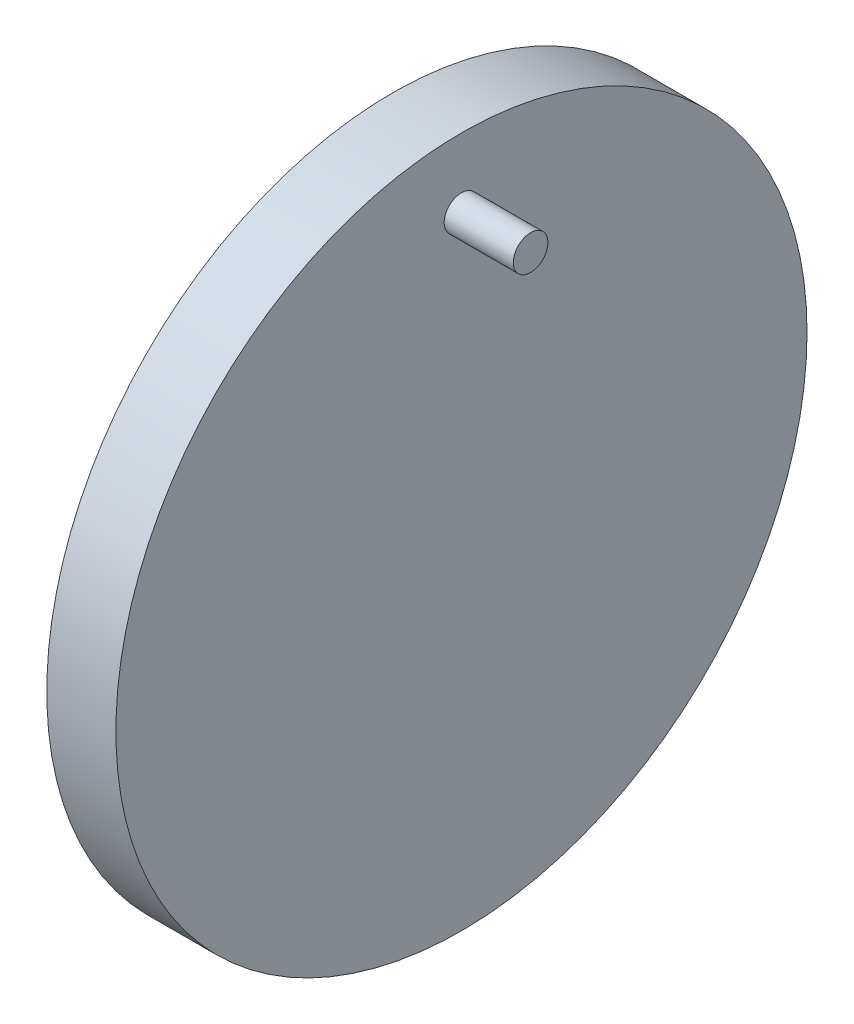
ISO-10303-21;
HEADER;
FILE_DESCRIPTION(('STEP AP214'),'2;1');
FILE_NAME('part.step','',(''),(''),'','','');
FILE_SCHEMA(('AUTOMOTIVE_DESIGN { 1 0 10303 214 1 1 1 1 }'));
ENDSEC;
DATA;
#1=APPLICATION_CONTEXT('core data for automotive mechanical design processes');
#2=APPLICATION_PROTOCOL_DEFINITION('international standard','automotive_design',2000,#1);
#3=PRODUCT_CONTEXT('',#1,'mechanical');
#4=PRODUCT('Part','Part','',(#3));
#5=PRODUCT_RELATED_PRODUCT_CATEGORY('part','',(#4));
#6=PRODUCT_DEFINITION_FORMATION('','',#4);
#7=PRODUCT_DEFINITION_CONTEXT('part definition',#1,'design');
#8=PRODUCT_DEFINITION('design','',#6,#7);
#9=PRODUCT_DEFINITION_SHAPE('','',#8);
#10=(LENGTH_UNIT() NAMED_UNIT(*) SI_UNIT(.MILLI.,.METRE.));
#11=(NAMED_UNIT(*) PLANE_ANGLE_UNIT() SI_UNIT($,.RADIAN.));
#12=(NAMED_UNIT(*) SI_UNIT($,.STERADIAN.) SOLID_ANGLE_UNIT());
#13=UNCERTAINTY_MEASURE_WITH_UNIT(LENGTH_MEASURE(1.E-05),#10,'distance_accuracy_value','');
#14=(GEOMETRIC_REPRESENTATION_CONTEXT(3) GLOBAL_UNCERTAINTY_ASSIGNED_CONTEXT((#13)) GLOBAL_UNIT_ASSIGNED_CONTEXT((#10,
#11,#12)) REPRESENTATION_CONTEXT('',''));
#15=CARTESIAN_POINT('',(0.,0.,0.));
#16=DIRECTION('',(0.,0.,1.));
#17=DIRECTION('',(1.,0.,0.));
#18=AXIS2_PLACEMENT_3D('',#15,#16,#17);
#19=CARTESIAN_POINT('',(10.,0.,0.));
#20=DIRECTION('',(-1.,0.,0.));
#21=DIRECTION('',(0.,0.,1.));
#22=AXIS2_PLACEMENT_3D('',#19,#20,#21);
#23=CYLINDRICAL_SURFACE('',#22,50.);
#24=CARTESIAN_POINT('',(10.,0.,0.));
#25=DIRECTION('',(1.,0.,0.));
#26=DIRECTION('',(0.,0.,-1.));
#27=AXIS2_PLACEMENT_3D('',#24,#25,#26);
#28=CIRCLE('',#27,50.);
#29=CARTESIAN_POINT('',(10.,0.,-50.));
#30=VERTEX_POINT('',#29);
#31=EDGE_CURVE('E10',#30,#30,#28,.T.);
#32=ORIENTED_EDGE('',*,*,#31,.F.);
#33=EDGE_LOOP('',(#32));
#34=FACE_BOUND('',#33,.T.);
#35=CARTESIAN_POINT('',(0.,0.,0.));
#36=DIRECTION('',(1.,0.,0.));
#37=DIRECTION('',(0.,0.,-1.));
#38=AXIS2_PLACEMENT_3D('',#35,#36,#37);
#39=CIRCLE('',#38,50.);
#40=CARTESIAN_POINT('',(0.,0.,-50.));
#41=VERTEX_POINT('',#40);
#42=EDGE_CURVE('E42',#41,#41,#39,.T.);
#43=ORIENTED_EDGE('',*,*,#42,.T.);
#44=EDGE_LOOP('',(#43));
#45=FACE_BOUND('',#44,.T.);
#46=ADVANCED_FACE('F39',(#34,#45),#23,.T.);
#47=CARTESIAN_POINT('',(10.,0.,0.));
#48=DIRECTION('',(1.,0.,0.));
#49=DIRECTION('',(0.,0.,-1.));
#50=AXIS2_PLACEMENT_3D('',#47,#48,#49);
#51=PLANE('',#50);
#52=CARTESIAN_POINT('',(10.,40.,0.));
#53=DIRECTION('',(1.,0.,0.));
#54=DIRECTION('',(0.,0.,-1.));
#55=AXIS2_PLACEMENT_3D('',#52,#53,#54);
#56=CIRCLE('',#55,2.5);
#57=CARTESIAN_POINT('',(10.,40.,-2.5));
#58=VERTEX_POINT('',#57);
#59=EDGE_CURVE('E53',#58,#58,#56,.T.);
#60=ORIENTED_EDGE('',*,*,#59,.F.);
#61=EDGE_LOOP('',(#60));
#62=FACE_BOUND('',#61,.T.);
#63=ORIENTED_EDGE('',*,*,#31,.T.);
#64=EDGE_LOOP('',(#63));
#65=FACE_BOUND('',#64,.T.);
#66=ADVANCED_FACE('F70',(#62,#65),#51,.T.);
#67=CARTESIAN_POINT('',(0.,0.,0.));
#68=DIRECTION('',(1.,0.,0.));
#69=DIRECTION('',(0.,0.,-1.));
#70=AXIS2_PLACEMENT_3D('',#67,#68,#69);
#71=PLANE('',#70);
#72=ORIENTED_EDGE('',*,*,#42,.F.);
#73=EDGE_LOOP('',(#72));
#74=FACE_BOUND('',#73,.T.);
#75=ADVANCED_FACE('F66',(#74),#71,.F.);
#76=CARTESIAN_POINT('',(20.,40.,0.));
#77=DIRECTION('',(-1.,0.,0.));
#78=DIRECTION('',(0.,0.,1.));
#79=AXIS2_PLACEMENT_3D('',#76,#77,#78);
#80=CYLINDRICAL_SURFACE('',#79,2.5);
#81=CARTESIAN_POINT('',(20.,40.,0.));
#82=DIRECTION('',(1.,0.,0.));
#83=DIRECTION('',(0.,0.,-1.));
#84=AXIS2_PLACEMENT_3D('',#81,#82,#83);
#85=CIRCLE('',#84,2.5);
#86=CARTESIAN_POINT('',(20.,40.,-2.5));
#87=VERTEX_POINT('',#86);
#88=EDGE_CURVE('E51',#87,#87,#85,.T.);
#89=ORIENTED_EDGE('',*,*,#88,.F.);
#90=EDGE_LOOP('',(#89));
#91=FACE_BOUND('',#90,.T.);
#92=ORIENTED_EDGE('',*,*,#59,.T.);
#93=EDGE_LOOP('',(#92));
#94=FACE_BOUND('',#93,.T.);
#95=ADVANCED_FACE('F63',(#91,#94),#80,.T.);
#96=CARTESIAN_POINT('',(20.,40.,0.));
#97=DIRECTION('',(1.,0.,0.));
#98=DIRECTION('',(0.,0.,-1.));
#99=AXIS2_PLACEMENT_3D('',#96,#97,#98);
#100=PLANE('',#99);
#101=ORIENTED_EDGE('',*,*,#88,.T.);
#102=EDGE_LOOP('',(#101));
#103=FACE_BOUND('',#102,.T.);
#104=ADVANCED_FACE('F61',(#103),#100,.T.);
#105=CLOSED_SHELL('',(#46,#66,#75,#95,#104));
#106=MANIFOLD_SOLID_BREP('B2',#105);
#107=ADVANCED_BREP_SHAPE_REPRESENTATION('',(#18,#106),#14);
#108=SHAPE_DEFINITION_REPRESENTATION(#9,#107);
ENDSEC;
END-ISO-10303-21;
